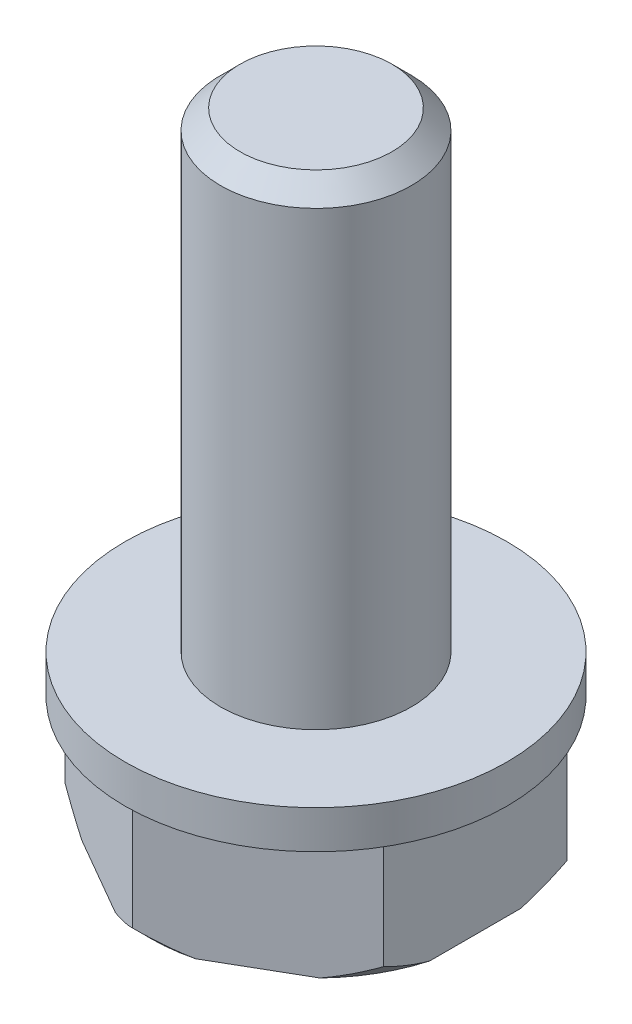
ISO-10303-21;
HEADER;
FILE_DESCRIPTION(('STEP AP214'),'2;1');
FILE_NAME('part.step','',(''),(''),'','','');
FILE_SCHEMA(('AUTOMOTIVE_DESIGN { 1 0 10303 214 1 1 1 1 }'));
ENDSEC;
DATA;
#1=APPLICATION_CONTEXT('core data for automotive mechanical design processes');
#2=APPLICATION_PROTOCOL_DEFINITION('international standard','automotive_design',2000,#1);
#3=PRODUCT_CONTEXT('',#1,'mechanical');
#4=PRODUCT('Part','Part','',(#3));
#5=PRODUCT_RELATED_PRODUCT_CATEGORY('part','',(#4));
#6=PRODUCT_DEFINITION_FORMATION('','',#4);
#7=PRODUCT_DEFINITION_CONTEXT('part definition',#1,'design');
#8=PRODUCT_DEFINITION('design','',#6,#7);
#9=PRODUCT_DEFINITION_SHAPE('','',#8);
#10=(LENGTH_UNIT() NAMED_UNIT(*) SI_UNIT(.MILLI.,.METRE.));
#11=(NAMED_UNIT(*) PLANE_ANGLE_UNIT() SI_UNIT($,.RADIAN.));
#12=(NAMED_UNIT(*) SI_UNIT($,.STERADIAN.) SOLID_ANGLE_UNIT());
#13=UNCERTAINTY_MEASURE_WITH_UNIT(LENGTH_MEASURE(1.E-05),#10,'distance_accuracy_value','');
#14=(GEOMETRIC_REPRESENTATION_CONTEXT(3) GLOBAL_UNCERTAINTY_ASSIGNED_CONTEXT((#13)) GLOBAL_UNIT_ASSIGNED_CONTEXT((#10,
#11,#12)) REPRESENTATION_CONTEXT('',''));
#15=CARTESIAN_POINT('',(0.,0.,0.));
#16=DIRECTION('',(0.,0.,1.));
#17=DIRECTION('',(1.,0.,0.));
#18=AXIS2_PLACEMENT_3D('',#15,#16,#17);
#19=CARTESIAN_POINT('',(22.6776695296637,96.5,14.7909181837156));
#20=DIRECTION('',(-0.5,0.,0.866025403784439));
#21=DIRECTION('',(0.866025403784439,0.,0.5));
#22=AXIS2_PLACEMENT_3D('',#19,#20,#21);
#23=PLANE('',#22);
#24=DIRECTION('',(0.,-1.,0.));
#25=VECTOR('',#24,1.);
#26=CARTESIAN_POINT('',(22.6776695296637,96.5,14.7909181837156));
#27=LINE('',#26,#25);
#28=CARTESIAN_POINT('',(22.6776695296637,50.5,14.7909181837156));
#29=VERTEX_POINT('',#28);
#30=CARTESIAN_POINT('',(22.6776695296637,47.0735026918963,14.7909181837156));
#31=VERTEX_POINT('',#30);
#32=EDGE_CURVE('E11',#29,#31,#27,.T.);
#33=ORIENTED_EDGE('',*,*,#32,.T.);
#34=CARTESIAN_POINT('',(21.414601217349,46.5,14.0616853535958));
#35=CARTESIAN_POINT('',(21.4664537594648,46.5164440766261,14.091623938227));
#36=CARTESIAN_POINT('',(21.5180895158105,46.5337687545802,14.1214486324146));
#37=CARTESIAN_POINT('',(21.6214874574526,46.5702823086314,14.1811796574282));
#38=CARTESIAN_POINT('',(21.6732446970938,46.5894897238432,14.2110832271335));
#39=CARTESIAN_POINT('',(21.7769756621481,46.6297670931508,14.2710096812821));
#40=CARTESIAN_POINT('',(21.8289432219276,46.6508582920278,14.3010289273305));
#41=CARTESIAN_POINT('',(21.9331790081629,46.6949003649628,14.3612296351021));
#42=CARTESIAN_POINT('',(21.9854399260141,46.7178745106764,14.3914067018588));
#43=CARTESIAN_POINT('',(22.0903392794409,46.7656807395659,14.4519664939412));
#44=CARTESIAN_POINT('',(22.1429693499514,46.7905375181192,14.4823441822286));
#45=CARTESIAN_POINT('',(22.2486773209186,46.8421079012049,14.5433494931069));
#46=CARTESIAN_POINT('',(22.3017459168783,46.8688470805479,14.5739715894766));
#47=CARTESIAN_POINT('',(22.4083946755418,46.9241810640024,14.6355096377957));
#48=CARTESIAN_POINT('',(22.4619647196343,46.9528018406309,14.6664197250956));
#49=CARTESIAN_POINT('',(22.56967482855,47.0119007649667,14.7285774640249));
#50=CARTESIAN_POINT('',(22.6238041115768,47.042404941688,14.7598190718213));
#51=CARTESIAN_POINT('',(22.6776695296637,47.0735026918963,14.7909181837156));
#52=B_SPLINE_CURVE_WITH_KNOTS('',3,(#34,#35,#36,#37,#38,#39,#40,#41,#42,#43,#44,#45,#46,#47,#48,
#49,#50,#51),.UNSPECIFIED.,.F.,.F.,(4,2,2,2,2,2,2,2,4),(0.,0.18626522227709,0.374595608167035,
0.565412784427951,0.759111232115713,0.956057798253879,1.15659171756843,1.36102506604505,
1.56964356219137),.UNSPECIFIED.);
#53=CARTESIAN_POINT('',(21.414601217349,46.5,14.0616853535958));
#54=VERTEX_POINT('',#53);
#55=EDGE_CURVE('E123',#54,#31,#52,.T.);
#56=ORIENTED_EDGE('',*,*,#55,.F.);
#57=DIRECTION('',(0.866025403784439,0.,0.5));
#58=VECTOR('',#57,1.);
#59=CARTESIAN_POINT('',(24.0776695296637,46.5,15.5992085605811));
#60=LINE('',#59,#58);
#61=CARTESIAN_POINT('',(18.9407378419784,46.5,12.6333996678872));
#62=VERTEX_POINT('',#61);
#63=EDGE_CURVE('E127',#62,#54,#60,.T.);
#64=ORIENTED_EDGE('',*,*,#63,.F.);
#65=CARTESIAN_POINT('',(17.6776695296637,47.0735026918963,11.9041668377674));
#66=CARTESIAN_POINT('',(17.7315348596427,47.042404941688,11.9352661022691));
#67=CARTESIAN_POINT('',(17.7856555271629,47.0119007649667,11.9665226325607));
#68=CARTESIAN_POINT('',(17.8933407625753,46.9528018406309,12.0287234536614));
#69=CARTESIAN_POINT('',(17.9468947054565,46.9241810640024,12.0596614290774));
#70=CARTESIAN_POINT('',(18.0535125979319,46.8688470805479,12.1212529392026));
#71=CARTESIAN_POINT('',(18.1065664092851,46.8421079012049,12.1519006432619));
#72=CARTESIAN_POINT('',(18.212252543755,46.7905375181192,12.2129437760629));
#73=CARTESIAN_POINT('',(18.2648754287754,46.7656807395659,12.2433339099842));
#74=CARTESIAN_POINT('',(18.36977142388,46.7178745106764,12.3038995188512));
#75=CARTESIAN_POINT('',(18.4220359892286,46.6949003649628,12.3340702679571));
#76=CARTESIAN_POINT('',(18.5262892246024,46.6508582920278,12.3942407529346));
#77=CARTESIAN_POINT('',(18.5782704341724,46.6297670931507,12.424236356852));
#78=CARTESIAN_POINT('',(18.682033748351,46.5894897238432,12.4841067806739));
#79=CARTESIAN_POINT('',(18.7338096192002,46.5702823086314,12.5139780801803));
#80=CARTESIAN_POINT('',(18.8372371750771,46.5337687545802,12.5736578118346));
#81=CARTESIAN_POINT('',(18.8888839960765,46.5164440766261,12.6034633414798));
#82=CARTESIAN_POINT('',(18.9407378419784,46.5,12.6333996678872));
#83=B_SPLINE_CURVE_WITH_KNOTS('',3,(#65,#66,#67,#68,#69,#70,#71,#72,#73,#74,#75,#76,#77,#78,#79,
#80,#81,#82),.UNSPECIFIED.,.F.,.F.,(4,2,2,2,2,2,2,2,4),(0.,0.208618496146334,0.413051844622961,
0.61358576393752,0.810532330075687,1.00423077776346,1.19504795402437,1.38337833991431,
1.56964356219139),.UNSPECIFIED.);
#84=CARTESIAN_POINT('',(17.6776695296637,47.0735026918963,11.9041668377674));
#85=VERTEX_POINT('',#84);
#86=EDGE_CURVE('E119',#85,#62,#83,.T.);
#87=ORIENTED_EDGE('',*,*,#86,.F.);
#88=DIRECTION('',(0.,-1.,0.));
#89=VECTOR('',#88,1.);
#90=CARTESIAN_POINT('',(17.6776695296637,96.5,11.9041668377674));
#91=LINE('',#90,#89);
#92=CARTESIAN_POINT('',(17.6776695296637,50.5,11.9041668377674));
#93=VERTEX_POINT('',#92);
#94=EDGE_CURVE('E503',#93,#85,#91,.T.);
#95=ORIENTED_EDGE('',*,*,#94,.F.);
#96=DIRECTION('',(-0.866025403784439,0.,-0.5));
#97=VECTOR('',#96,1.);
#98=CARTESIAN_POINT('',(22.4276695296637,50.5,14.6465806164181));
#99=LINE('',#98,#97);
#100=EDGE_CURVE('E472',#29,#93,#99,.T.);
#101=ORIENTED_EDGE('',*,*,#100,.F.);
#102=EDGE_LOOP('',(#33,#56,#64,#87,#95,#101));
#103=FACE_BOUND('',#102,.T.);
#104=ADVANCED_FACE('F16',(#103),#23,.F.);
#105=CARTESIAN_POINT('',(22.6776695296637,96.5,20.5644208756118));
#106=DIRECTION('',(-1.,0.,0.));
#107=DIRECTION('',(0.,0.,1.));
#108=AXIS2_PLACEMENT_3D('',#105,#106,#107);
#109=PLANE('',#108);
#110=DIRECTION('',(0.,-1.,0.));
#111=VECTOR('',#110,1.);
#112=CARTESIAN_POINT('',(22.6776695296637,96.5,20.5644208756118));
#113=LINE('',#112,#111);
#114=CARTESIAN_POINT('',(22.6776695296637,50.5,20.5644208756118));
#115=VERTEX_POINT('',#114);
#116=CARTESIAN_POINT('',(22.6776695296637,47.0735026918963,20.5644208756118));
#117=VERTEX_POINT('',#116);
#118=EDGE_CURVE('E347',#115,#117,#113,.T.);
#119=ORIENTED_EDGE('',*,*,#118,.T.);
#120=CARTESIAN_POINT('',(22.6776695296637,46.5,19.1059552153723));
#121=CARTESIAN_POINT('',(22.6776682258776,46.5164440766261,19.1658301264109));
#122=CARTESIAN_POINT('',(22.6776571612239,46.5337687545802,19.2254603502437));
#123=CARTESIAN_POINT('',(22.6776275469891,46.5702823086314,19.3448711069116));
#124=CARTESIAN_POINT('',(22.6776089157811,46.5894897238432,19.4046459761233));
#125=CARTESIAN_POINT('',(22.6775765666569,46.6297670931507,19.5244428540937));
#126=CARTESIAN_POINT('',(22.6775629168662,46.6508582920278,19.5844577040596));
#127=CARTESIAN_POINT('',(22.6775454677278,46.6949003649628,19.7048288968087));
#128=CARTESIAN_POINT('',(22.6775418202305,46.7178745106764,19.7651767126713));
#129=CARTESIAN_POINT('',(22.6775451785526,46.7656807395659,19.8863021136206));
#130=CARTESIAN_POINT('',(22.6775523640427,46.7905375181192,19.9470699358293));
#131=CARTESIAN_POINT('',(22.67757420054,46.8421079012049,20.0691183795086));
#132=CARTESIAN_POINT('',(22.6775889851464,46.8688470805479,20.1303881799377));
#133=CARTESIAN_POINT('',(22.6776198513346,46.9241810640024,20.2535177383819));
#134=CARTESIAN_POINT('',(22.677635952546,46.9528018406309,20.3153658010979));
#135=CARTESIAN_POINT('',(22.6776608260492,47.0119007649667,20.4397243611279));
#136=CARTESIAN_POINT('',(22.6776694415558,47.042404941688,20.502222499216));
#137=CARTESIAN_POINT('',(22.6776695296637,47.0735026918963,20.5644208756118));
#138=B_SPLINE_CURVE_WITH_KNOTS('',3,(#120,#121,#122,#123,#124,#125,#126,#127,#128,#129,#130,
#131,#132,#133,#134,#135,#136,#137),.UNSPECIFIED.,.F.,.F.,(4,2,2,2,2,2,2,2,4),(0.,
0.186265222277086,0.37459560816702,0.565412784427934,0.759111232115698,0.956057798253866,
1.15659171756843,1.36102506604505,1.56964356219139),.UNSPECIFIED.);
#139=CARTESIAN_POINT('',(22.6776695296637,46.5,19.1059552153723));
#140=VERTEX_POINT('',#139);
#141=EDGE_CURVE('E28',#140,#117,#138,.T.);
#142=ORIENTED_EDGE('',*,*,#141,.F.);
#143=DIRECTION('',(0.,0.,1.));
#144=VECTOR('',#143,1.);
#145=CARTESIAN_POINT('',(22.6776695296637,46.5,17.6776695296637));
#146=LINE('',#145,#144);
#147=CARTESIAN_POINT('',(22.6776695296637,46.5,16.2493838439551));
#148=VERTEX_POINT('',#147);
#149=EDGE_CURVE('E140',#148,#140,#146,.T.);
#150=ORIENTED_EDGE('',*,*,#149,.F.);
#151=CARTESIAN_POINT('',(22.6776695296637,47.0735026918963,14.7909181837156));
#152=CARTESIAN_POINT('',(22.6776694415558,47.0424049416879,14.8531165601115));
#153=CARTESIAN_POINT('',(22.6776608260492,47.0119007649667,14.9156146981996));
#154=CARTESIAN_POINT('',(22.677635952546,46.9528018406309,15.0399732582295));
#155=CARTESIAN_POINT('',(22.6776198513346,46.9241810640024,15.1018213209455));
#156=CARTESIAN_POINT('',(22.6775889851464,46.8688470805479,15.2249508793897));
#157=CARTESIAN_POINT('',(22.67757420054,46.8421079012049,15.2862206798188));
#158=CARTESIAN_POINT('',(22.6775523640427,46.7905375181192,15.4082691234981));
#159=CARTESIAN_POINT('',(22.6775451785526,46.7656807395659,15.4690369457068));
#160=CARTESIAN_POINT('',(22.6775418202304,46.7178745106764,15.5901623466562));
#161=CARTESIAN_POINT('',(22.6775454677278,46.6949003649628,15.6505101625187));
#162=CARTESIAN_POINT('',(22.6775629168662,46.6508582920278,15.7708813552679));
#163=CARTESIAN_POINT('',(22.6775765666568,46.6297670931507,15.8308962052337));
#164=CARTESIAN_POINT('',(22.6776089157811,46.5894897238432,15.9506930832041));
#165=CARTESIAN_POINT('',(22.6776275469891,46.5702823086314,16.0104679524158));
#166=CARTESIAN_POINT('',(22.6776571612239,46.5337687545802,16.1298787090837));
#167=CARTESIAN_POINT('',(22.6776682258776,46.5164440766261,16.1895089329165));
#168=CARTESIAN_POINT('',(22.6776695296637,46.5,16.2493838439551));
#169=B_SPLINE_CURVE_WITH_KNOTS('',3,(#151,#152,#153,#154,#155,#156,#157,#158,#159,#160,#161,
#162,#163,#164,#165,#166,#167,#168),.UNSPECIFIED.,.F.,.F.,(4,2,2,2,2,2,2,2,4),(0.,
0.208618496146355,0.413051844622992,0.613585763937557,0.810532330075726,1.00423077776349,
1.19504795402439,1.38337833991431,1.56964356219138),.UNSPECIFIED.);
#170=EDGE_CURVE('E131',#31,#148,#169,.T.);
#171=ORIENTED_EDGE('',*,*,#170,.F.);
#172=ORIENTED_EDGE('',*,*,#32,.F.);
#173=DIRECTION('',(0.,0.,-1.));
#174=VECTOR('',#173,1.);
#175=CARTESIAN_POINT('',(22.6776695296637,50.5,17.6776695296637));
#176=LINE('',#175,#174);
#177=EDGE_CURVE('E469',#115,#29,#176,.T.);
#178=ORIENTED_EDGE('',*,*,#177,.F.);
#179=EDGE_LOOP('',(#119,#142,#150,#171,#172,#178));
#180=FACE_BOUND('',#179,.T.);
#181=ADVANCED_FACE('F411',(#180),#109,.F.);
#182=CARTESIAN_POINT('',(17.6776695296637,47.3,17.6776695296637));
#183=DIRECTION('',(0.,1.,0.));
#184=DIRECTION('',(0.,0.,1.));
#185=AXIS2_PLACEMENT_3D('',#182,#183,#184);
#186=CONICAL_SURFACE('',#185,6.,0.785398163397448);
#187=CARTESIAN_POINT('',(17.6776695296637,46.5,17.6776695296637));
#188=DIRECTION('',(0.,-1.,0.));
#189=DIRECTION('',(0.,0.,-1.));
#190=AXIS2_PLACEMENT_3D('',#187,#188,#189);
#191=CIRCLE('',#190,5.2);
#192=CARTESIAN_POINT('',(21.414601217349,46.5,21.2936537057316));
#193=VERTEX_POINT('',#192);
#194=EDGE_CURVE('E333',#140,#193,#191,.T.);
#195=ORIENTED_EDGE('',*,*,#194,.F.);
#196=ORIENTED_EDGE('',*,*,#141,.T.);
#197=CARTESIAN_POINT('',(22.6776695296637,47.0735026918963,20.5644208756118));
#198=CARTESIAN_POINT('',(22.6238041115768,47.042404941688,20.5955199875061));
#199=CARTESIAN_POINT('',(22.56967482855,47.0119007649667,20.6267615953025));
#200=CARTESIAN_POINT('',(22.4619647196343,46.9528018406309,20.6889193342319));
#201=CARTESIAN_POINT('',(22.4083946755418,46.9241810640024,20.7198294215318));
#202=CARTESIAN_POINT('',(22.3017459168782,46.8688470805479,20.7813674698508));
#203=CARTESIAN_POINT('',(22.2486773209186,46.8421079012049,20.8119895662206));
#204=CARTESIAN_POINT('',(22.1429693499514,46.7905375181192,20.8729948770988));
#205=CARTESIAN_POINT('',(22.0903392794409,46.7656807395659,20.9033725653862));
#206=CARTESIAN_POINT('',(21.9854399260141,46.7178745106764,20.9639323574686));
#207=CARTESIAN_POINT('',(21.9331790081629,46.6949003649628,20.9941094242253));
#208=CARTESIAN_POINT('',(21.8289432219275,46.6508582920278,21.054310131997));
#209=CARTESIAN_POINT('',(21.7769756621481,46.6297670931507,21.0843293780454));
#210=CARTESIAN_POINT('',(21.6732446970938,46.5894897238432,21.1442558321939));
#211=CARTESIAN_POINT('',(21.6214874574525,46.5702823086314,21.1741594018992));
#212=CARTESIAN_POINT('',(21.5180895158105,46.5337687545802,21.2338904269128));
#213=CARTESIAN_POINT('',(21.4664537594648,46.5164440766261,21.2637151211004));
#214=CARTESIAN_POINT('',(21.414601217349,46.5,21.2936537057316));
#215=B_SPLINE_CURVE_WITH_KNOTS('',3,(#197,#198,#199,#200,#201,#202,#203,#204,#205,#206,#207,
#208,#209,#210,#211,#212,#213,#214),.UNSPECIFIED.,.F.,.F.,(4,2,2,2,2,2,2,2,4),(0.,
0.208618496146343,0.413051844622975,0.613585763937536,0.810532330075706,1.00423077776347,
1.19504795402438,1.38337833991431,1.56964356219138),.UNSPECIFIED.);
#216=EDGE_CURVE('E388',#117,#193,#215,.T.);
#217=ORIENTED_EDGE('',*,*,#216,.T.);
#218=EDGE_LOOP('',(#195,#196,#217));
#219=FACE_BOUND('',#218,.T.);
#220=ADVANCED_FACE('F173',(#219),#186,.T.);
#221=CARTESIAN_POINT('',(17.6776695296637,47.3,17.6776695296637));
#222=DIRECTION('',(0.,1.,0.));
#223=DIRECTION('',(0.,0.,1.));
#224=AXIS2_PLACEMENT_3D('',#221,#222,#223);
#225=CONICAL_SURFACE('',#224,6.,0.785398163397448);
#226=CARTESIAN_POINT('',(17.6776695296637,46.5,17.6776695296637));
#227=DIRECTION('',(0.,-1.,0.));
#228=DIRECTION('',(0.,0.,-1.));
#229=AXIS2_PLACEMENT_3D('',#226,#227,#228);
#230=CIRCLE('',#229,5.2);
#231=EDGE_CURVE('E135',#54,#148,#230,.T.);
#232=ORIENTED_EDGE('',*,*,#231,.F.);
#233=ORIENTED_EDGE('',*,*,#55,.T.);
#234=ORIENTED_EDGE('',*,*,#170,.T.);
#235=EDGE_LOOP('',(#232,#233,#234));
#236=FACE_BOUND('',#235,.T.);
#237=ADVANCED_FACE('F136',(#236),#225,.T.);
#238=CARTESIAN_POINT('',(17.6776695296637,47.3,17.6776695296637));
#239=DIRECTION('',(0.,1.,0.));
#240=DIRECTION('',(0.,0.,1.));
#241=AXIS2_PLACEMENT_3D('',#238,#239,#240);
#242=CONICAL_SURFACE('',#241,6.,0.785398163397448);
#243=CARTESIAN_POINT('',(17.6776695296637,46.5,17.6776695296637));
#244=DIRECTION('',(0.,-1.,0.));
#245=DIRECTION('',(0.,0.,-1.));
#246=AXIS2_PLACEMENT_3D('',#243,#244,#245);
#247=CIRCLE('',#246,5.2);
#248=CARTESIAN_POINT('',(16.414601217349,46.5,12.6333996678872));
#249=VERTEX_POINT('',#248);
#250=EDGE_CURVE('E144',#249,#62,#247,.T.);
#251=ORIENTED_EDGE('',*,*,#250,.F.);
#252=CARTESIAN_POINT('',(16.414601217349,46.5,12.6333996678872));
#253=CARTESIAN_POINT('',(16.4664550632509,46.5164440766261,12.6034633414798));
#254=CARTESIAN_POINT('',(16.5181018842503,46.5337687545802,12.5736578118346));
#255=CARTESIAN_POINT('',(16.6215294401272,46.5702823086314,12.5139780801803));
#256=CARTESIAN_POINT('',(16.6733053109764,46.5894897238432,12.4841067806739));
#257=CARTESIAN_POINT('',(16.777068625155,46.6297670931507,12.424236356852));
#258=CARTESIAN_POINT('',(16.829049834725,46.6508582920278,12.3942407529346));
#259=CARTESIAN_POINT('',(16.9333030700988,46.6949003649628,12.3340702679571));
#260=CARTESIAN_POINT('',(16.9855676354474,46.7178745106764,12.3038995188512));
#261=CARTESIAN_POINT('',(17.090463630552,46.7656807395659,12.2433339099842));
#262=CARTESIAN_POINT('',(17.1430865155724,46.7905375181192,12.2129437760629));
#263=CARTESIAN_POINT('',(17.2487726500424,46.8421079012049,12.1519006432619));
#264=CARTESIAN_POINT('',(17.3018264613956,46.8688470805479,12.1212529392026));
#265=CARTESIAN_POINT('',(17.4084443538709,46.9241810640024,12.0596614290774));
#266=CARTESIAN_POINT('',(17.4619982967521,46.9528018406309,12.0287234536614));
#267=CARTESIAN_POINT('',(17.5696835321645,47.0119007649667,11.9665226325607));
#268=CARTESIAN_POINT('',(17.6238041996847,47.0424049416879,11.9352661022691));
#269=CARTESIAN_POINT('',(17.6776695296637,47.0735026918963,11.9041668377675));
#270=B_SPLINE_CURVE_WITH_KNOTS('',3,(#252,#253,#254,#255,#256,#257,#258,#259,#260,#261,#262,
#263,#264,#265,#266,#267,#268,#269),.UNSPECIFIED.,.F.,.F.,(4,2,2,2,2,2,2,2,4),(0.,
0.186265222277095,0.374595608167032,0.565412784427947,0.759111232115718,0.956057798253885,
1.15659171756844,1.36102506604506,1.56964356219139),.UNSPECIFIED.);
#271=EDGE_CURVE('E192',#249,#85,#270,.T.);
#272=ORIENTED_EDGE('',*,*,#271,.T.);
#273=ORIENTED_EDGE('',*,*,#86,.T.);
#274=EDGE_LOOP('',(#251,#272,#273));
#275=FACE_BOUND('',#274,.T.);
#276=ADVANCED_FACE('F159',(#275),#242,.T.);
#277=CARTESIAN_POINT('',(17.6776695296637,51.7,17.6776695296637));
#278=DIRECTION('',(0.,-1.,0.));
#279=DIRECTION('',(0.,0.,-1.));
#280=AXIS2_PLACEMENT_3D('',#277,#278,#279);
#281=PLANE('',#280);
#282=CARTESIAN_POINT('',(17.6776695296637,51.7,17.6776695296637));
#283=DIRECTION('',(0.,-1.,0.));
#284=DIRECTION('',(0.,0.,-1.));
#285=AXIS2_PLACEMENT_3D('',#282,#283,#284);
#286=CIRCLE('',#285,3.);
#287=CARTESIAN_POINT('',(17.6776695296637,51.7,14.6776695296637));
#288=VERTEX_POINT('',#287);
#289=EDGE_CURVE('E54',#288,#288,#286,.T.);
#290=ORIENTED_EDGE('',*,*,#289,.T.);
#291=EDGE_LOOP('',(#290));
#292=FACE_BOUND('',#291,.T.);
#293=CARTESIAN_POINT('',(17.6776695296637,51.7,17.6776695296637));
#294=DIRECTION('',(0.,-1.,0.));
#295=DIRECTION('',(0.,0.,-1.));
#296=AXIS2_PLACEMENT_3D('',#293,#294,#295);
#297=CIRCLE('',#296,6.);
#298=CARTESIAN_POINT('',(17.6776695296637,51.7,11.6776695296637));
#299=VERTEX_POINT('',#298);
#300=EDGE_CURVE('E498',#299,#299,#297,.T.);
#301=ORIENTED_EDGE('',*,*,#300,.F.);
#302=EDGE_LOOP('',(#301));
#303=FACE_BOUND('',#302,.T.);
#304=ADVANCED_FACE('F169',(#292,#303),#281,.F.);
#305=CARTESIAN_POINT('',(17.6776695296637,47.3,17.6776695296637));
#306=DIRECTION('',(0.,1.,0.));
#307=DIRECTION('',(0.,0.,1.));
#308=AXIS2_PLACEMENT_3D('',#305,#306,#307);
#309=CONICAL_SURFACE('',#308,6.,0.785398163397448);
#310=CARTESIAN_POINT('',(17.6776695296637,46.5,17.6776695296637));
#311=DIRECTION('',(0.,-1.,0.));
#312=DIRECTION('',(0.,0.,-1.));
#313=AXIS2_PLACEMENT_3D('',#310,#311,#312);
#314=CIRCLE('',#313,5.2);
#315=CARTESIAN_POINT('',(12.6776695296637,46.5,16.2493838439551));
#316=VERTEX_POINT('',#315);
#317=CARTESIAN_POINT('',(13.9407378419784,46.5,14.0616853535958));
#318=VERTEX_POINT('',#317);
#319=EDGE_CURVE('E234',#316,#318,#314,.T.);
#320=ORIENTED_EDGE('',*,*,#319,.F.);
#321=CARTESIAN_POINT('',(12.6776695296637,46.5,16.2493838439551));
#322=CARTESIAN_POINT('',(12.6776708334498,46.5164440766261,16.1895089329165));
#323=CARTESIAN_POINT('',(12.6776818981035,46.5337687545802,16.1298787090837));
#324=CARTESIAN_POINT('',(12.6777115123383,46.5702823086314,16.0104679524158));
#325=CARTESIAN_POINT('',(12.6777301435463,46.5894897238432,15.9506930832041));
#326=CARTESIAN_POINT('',(12.6777624926705,46.6297670931507,15.8308962052337));
#327=CARTESIAN_POINT('',(12.6777761424612,46.6508582920278,15.7708813552678));
#328=CARTESIAN_POINT('',(12.6777935915996,46.6949003649628,15.6505101625187));
#329=CARTESIAN_POINT('',(12.677797239097,46.7178745106764,15.5901623466561));
#330=CARTESIAN_POINT('',(12.6777938807748,46.7656807395659,15.4690369457068));
#331=CARTESIAN_POINT('',(12.6777866952847,46.7905375181192,15.408269123498));
#332=CARTESIAN_POINT('',(12.6777648587874,46.8421079012049,15.2862206798188));
#333=CARTESIAN_POINT('',(12.677750074181,46.8688470805479,15.2249508793897));
#334=CARTESIAN_POINT('',(12.6777192079928,46.9241810640024,15.1018213209455));
#335=CARTESIAN_POINT('',(12.6777031067815,46.9528018406309,15.0399732582295));
#336=CARTESIAN_POINT('',(12.6776782332782,47.0119007649667,14.9156146981995));
#337=CARTESIAN_POINT('',(12.6776696177716,47.042404941688,14.8531165601114));
#338=CARTESIAN_POINT('',(12.6776695296637,47.0735026918963,14.7909181837156));
#339=B_SPLINE_CURVE_WITH_KNOTS('',3,(#321,#322,#323,#324,#325,#326,#327,#328,#329,#330,#331,
#332,#333,#334,#335,#336,#337,#338),.UNSPECIFIED.,.F.,.F.,(4,2,2,2,2,2,2,2,4),(0.,
0.186265222277096,0.37459560816703,0.56541278442795,0.759111232115718,0.956057798253889,
1.15659171756845,1.36102506604506,1.56964356219139),.UNSPECIFIED.);
#340=CARTESIAN_POINT('',(12.6776695296637,47.0735026918963,14.7909181837156));
#341=VERTEX_POINT('',#340);
#342=EDGE_CURVE('E229',#316,#341,#339,.T.);
#343=ORIENTED_EDGE('',*,*,#342,.T.);
#344=CARTESIAN_POINT('',(12.6776695296637,47.0735026918963,14.7909181837156));
#345=CARTESIAN_POINT('',(12.7315349477506,47.042404941688,14.7598190718213));
#346=CARTESIAN_POINT('',(12.7856642307774,47.0119007649667,14.7285774640249));
#347=CARTESIAN_POINT('',(12.8933743396931,46.9528018406309,14.6664197250956));
#348=CARTESIAN_POINT('',(12.9469443837856,46.9241810640024,14.6355096377957));
#349=CARTESIAN_POINT('',(13.0535931424492,46.8688470805479,14.5739715894766));
#350=CARTESIAN_POINT('',(13.1066617384088,46.8421079012049,14.5433494931068));
#351=CARTESIAN_POINT('',(13.212369709376,46.7905375181192,14.4823441822286));
#352=CARTESIAN_POINT('',(13.2649997798865,46.7656807395659,14.4519664939412));
#353=CARTESIAN_POINT('',(13.3698991333133,46.7178745106764,14.3914067018588));
#354=CARTESIAN_POINT('',(13.4221600511645,46.6949003649628,14.3612296351021));
#355=CARTESIAN_POINT('',(13.5263958373999,46.6508582920278,14.3010289273304));
#356=CARTESIAN_POINT('',(13.5783633971793,46.6297670931507,14.2710096812821));
#357=CARTESIAN_POINT('',(13.6820943622336,46.5894897238432,14.2110832271335));
#358=CARTESIAN_POINT('',(13.7338516018748,46.5702823086314,14.1811796574282));
#359=CARTESIAN_POINT('',(13.8372495435169,46.5337687545802,14.1214486324146));
#360=CARTESIAN_POINT('',(13.8888852998626,46.5164440766261,14.091623938227));
#361=CARTESIAN_POINT('',(13.9407378419784,46.5,14.0616853535958));
#362=B_SPLINE_CURVE_WITH_KNOTS('',3,(#344,#345,#346,#347,#348,#349,#350,#351,#352,#353,#354,
#355,#356,#357,#358,#359,#360,#361),.UNSPECIFIED.,.F.,.F.,(4,2,2,2,2,2,2,2,4),(0.,
0.208618496146333,0.413051844622951,0.613585763937507,0.810532330075671,1.00423077776344,
1.19504795402435,1.38337833991428,1.56964356219137),.UNSPECIFIED.);
#363=EDGE_CURVE('E499',#341,#318,#362,.T.);
#364=ORIENTED_EDGE('',*,*,#363,.T.);
#365=EDGE_LOOP('',(#320,#343,#364));
#366=FACE_BOUND('',#365,.T.);
#367=ADVANCED_FACE('F170',(#366),#309,.T.);
#368=CARTESIAN_POINT('',(17.6776695296637,50.5,17.6776695296637));
#369=DIRECTION('',(0.,-1.,0.));
#370=DIRECTION('',(0.,0.,-1.));
#371=AXIS2_PLACEMENT_3D('',#368,#369,#370);
#372=CYLINDRICAL_SURFACE('',#371,6.);
#373=ORIENTED_EDGE('',*,*,#300,.T.);
#374=EDGE_LOOP('',(#373));
#375=FACE_BOUND('',#374,.T.);
#376=CARTESIAN_POINT('',(17.6776695296637,50.5,17.6776695296637));
#377=DIRECTION('',(0.,-1.,0.));
#378=DIRECTION('',(0.,0.,-1.));
#379=AXIS2_PLACEMENT_3D('',#376,#377,#378);
#380=CIRCLE('',#379,6.);
#381=CARTESIAN_POINT('',(17.6776695296637,50.5,11.6776695296637));
#382=VERTEX_POINT('',#381);
#383=EDGE_CURVE('E230',#382,#382,#380,.T.);
#384=ORIENTED_EDGE('',*,*,#383,.F.);
#385=EDGE_LOOP('',(#384));
#386=FACE_BOUND('',#385,.T.);
#387=ADVANCED_FACE('F210',(#375,#386),#372,.T.);
#388=CARTESIAN_POINT('',(17.6776695296637,96.5,11.9041668377674));
#389=DIRECTION('',(0.5,0.,0.866025403784439));
#390=DIRECTION('',(0.866025403784439,0.,-0.5));
#391=AXIS2_PLACEMENT_3D('',#388,#389,#390);
#392=PLANE('',#391);
#393=ORIENTED_EDGE('',*,*,#94,.T.);
#394=ORIENTED_EDGE('',*,*,#271,.F.);
#395=DIRECTION('',(0.866025403784439,0.,-0.5));
#396=VECTOR('',#395,1.);
#397=CARTESIAN_POINT('',(19.0776695296637,46.5,11.0958764609019));
#398=LINE('',#397,#396);
#399=EDGE_CURVE('E146',#318,#249,#398,.T.);
#400=ORIENTED_EDGE('',*,*,#399,.F.);
#401=ORIENTED_EDGE('',*,*,#363,.F.);
#402=DIRECTION('',(0.,-1.,0.));
#403=VECTOR('',#402,1.);
#404=CARTESIAN_POINT('',(12.6776695296637,96.5,14.7909181837156));
#405=LINE('',#404,#403);
#406=CARTESIAN_POINT('',(12.6776695296637,50.5,14.7909181837156));
#407=VERTEX_POINT('',#406);
#408=EDGE_CURVE('E221',#407,#341,#405,.T.);
#409=ORIENTED_EDGE('',*,*,#408,.F.);
#410=DIRECTION('',(-0.866025403784439,0.,0.5));
#411=VECTOR('',#410,1.);
#412=CARTESIAN_POINT('',(17.4276695296637,50.5,12.0485044050648));
#413=LINE('',#412,#411);
#414=EDGE_CURVE('E489',#93,#407,#413,.T.);
#415=ORIENTED_EDGE('',*,*,#414,.F.);
#416=EDGE_LOOP('',(#393,#394,#400,#401,#409,#415));
#417=FACE_BOUND('',#416,.T.);
#418=ADVANCED_FACE('F199',(#417),#392,.F.);
#419=CARTESIAN_POINT('',(12.6776695296637,96.5,14.7909181837156));
#420=DIRECTION('',(1.,0.,0.));
#421=DIRECTION('',(0.,0.,-1.));
#422=AXIS2_PLACEMENT_3D('',#419,#420,#421);
#423=PLANE('',#422);
#424=ORIENTED_EDGE('',*,*,#408,.T.);
#425=ORIENTED_EDGE('',*,*,#342,.F.);
#426=DIRECTION('',(0.,0.,-1.));
#427=VECTOR('',#426,1.);
#428=CARTESIAN_POINT('',(12.6776695296637,46.5,17.6776695296637));
#429=LINE('',#428,#427);
#430=CARTESIAN_POINT('',(12.6776695296637,46.5,19.1059552153723));
#431=VERTEX_POINT('',#430);
#432=EDGE_CURVE('E238',#431,#316,#429,.T.);
#433=ORIENTED_EDGE('',*,*,#432,.F.);
#434=CARTESIAN_POINT('',(12.6776695296637,47.0735026918963,20.5644208756118));
#435=CARTESIAN_POINT('',(12.6776696177716,47.0424049416879,20.502222499216));
#436=CARTESIAN_POINT('',(12.6776782332782,47.0119007649667,20.4397243611279));
#437=CARTESIAN_POINT('',(12.6777031067814,46.9528018406309,20.3153658010979));
#438=CARTESIAN_POINT('',(12.6777192079928,46.9241810640024,20.2535177383819));
#439=CARTESIAN_POINT('',(12.677750074181,46.8688470805479,20.1303881799377));
#440=CARTESIAN_POINT('',(12.6777648587874,46.8421079012049,20.0691183795086));
#441=CARTESIAN_POINT('',(12.6777866952847,46.7905375181192,19.9470699358293));
#442=CARTESIAN_POINT('',(12.6777938807748,46.7656807395659,19.8863021136206));
#443=CARTESIAN_POINT('',(12.677797239097,46.7178745106764,19.7651767126712));
#444=CARTESIAN_POINT('',(12.6777935915996,46.6949003649628,19.7048288968087));
#445=CARTESIAN_POINT('',(12.6777761424612,46.6508582920278,19.5844577040595));
#446=CARTESIAN_POINT('',(12.6777624926706,46.6297670931507,19.5244428540937));
#447=CARTESIAN_POINT('',(12.6777301435463,46.5894897238432,19.4046459761233));
#448=CARTESIAN_POINT('',(12.6777115123383,46.5702823086314,19.3448711069116));
#449=CARTESIAN_POINT('',(12.6776818981035,46.5337687545802,19.2254603502437));
#450=CARTESIAN_POINT('',(12.6776708334498,46.5164440766261,19.165830126411));
#451=CARTESIAN_POINT('',(12.6776695296637,46.5,19.1059552153723));
#452=B_SPLINE_CURVE_WITH_KNOTS('',3,(#434,#435,#436,#437,#438,#439,#440,#441,#442,#443,#444,
#445,#446,#447,#448,#449,#450,#451),.UNSPECIFIED.,.F.,.F.,(4,2,2,2,2,2,2,2,4),(0.,
0.208618496146364,0.413051844623002,0.613585763937568,0.810532330075742,1.0042307777635,
1.1950479540244,1.38337833991432,1.56964356219138),.UNSPECIFIED.);
#453=CARTESIAN_POINT('',(12.6776695296637,47.0735026918963,20.5644208756118));
#454=VERTEX_POINT('',#453);
#455=EDGE_CURVE('E258',#454,#431,#452,.T.);
#456=ORIENTED_EDGE('',*,*,#455,.F.);
#457=DIRECTION('',(0.,-1.,0.));
#458=VECTOR('',#457,1.);
#459=CARTESIAN_POINT('',(12.6776695296637,96.5,20.5644208756118));
#460=LINE('',#459,#458);
#461=CARTESIAN_POINT('',(12.6776695296637,50.5,20.5644208756118));
#462=VERTEX_POINT('',#461);
#463=EDGE_CURVE('E341',#462,#454,#460,.T.);
#464=ORIENTED_EDGE('',*,*,#463,.F.);
#465=DIRECTION('',(0.,0.,1.));
#466=VECTOR('',#465,1.);
#467=CARTESIAN_POINT('',(12.6776695296637,50.5,17.6776695296637));
#468=LINE('',#467,#466);
#469=EDGE_CURVE('E477',#407,#462,#468,.T.);
#470=ORIENTED_EDGE('',*,*,#469,.F.);
#471=EDGE_LOOP('',(#424,#425,#433,#456,#464,#470));
#472=FACE_BOUND('',#471,.T.);
#473=ADVANCED_FACE('F209',(#472),#423,.F.);
#474=CARTESIAN_POINT('',(23.6776695296637,50.5,17.6776695296637));
#475=DIRECTION('',(0.,1.,0.));
#476=DIRECTION('',(0.,0.,1.));
#477=AXIS2_PLACEMENT_3D('',#474,#475,#476);
#478=PLANE('',#477);
#479=ORIENTED_EDGE('',*,*,#383,.T.);
#480=EDGE_LOOP('',(#479));
#481=FACE_BOUND('',#480,.T.);
#482=ORIENTED_EDGE('',*,*,#177,.T.);
#483=ORIENTED_EDGE('',*,*,#100,.T.);
#484=ORIENTED_EDGE('',*,*,#414,.T.);
#485=ORIENTED_EDGE('',*,*,#469,.T.);
#486=DIRECTION('',(0.866025403784439,0.,0.5));
#487=VECTOR('',#486,1.);
#488=CARTESIAN_POINT('',(17.4276695296637,50.5,23.3068346542625));
#489=LINE('',#488,#487);
#490=CARTESIAN_POINT('',(17.6776695296637,50.5,23.4511722215599));
#491=VERTEX_POINT('',#490);
#492=EDGE_CURVE('E245',#462,#491,#489,.T.);
#493=ORIENTED_EDGE('',*,*,#492,.T.);
#494=DIRECTION('',(0.866025403784439,0.,-0.5));
#495=VECTOR('',#494,1.);
#496=CARTESIAN_POINT('',(22.4276695296637,50.5,20.7087584429092));
#497=LINE('',#496,#495);
#498=EDGE_CURVE('E342',#491,#115,#497,.T.);
#499=ORIENTED_EDGE('',*,*,#498,.T.);
#500=EDGE_LOOP('',(#482,#483,#484,#485,#493,#499));
#501=FACE_BOUND('',#500,.T.);
#502=ADVANCED_FACE('F448',(#481,#501),#478,.F.);
#503=CARTESIAN_POINT('',(17.6776695296637,66.5,17.6776695296637));
#504=DIRECTION('',(0.,-1.,0.));
#505=DIRECTION('',(0.,0.,-1.));
#506=AXIS2_PLACEMENT_3D('',#503,#504,#505);
#507=CONICAL_SURFACE('',#506,2.3865,0.785398163397446);
#508=CARTESIAN_POINT('',(17.6776695296637,66.5,17.6776695296637));
#509=DIRECTION('',(0.,-1.,0.));
#510=DIRECTION('',(0.,0.,-1.));
#511=AXIS2_PLACEMENT_3D('',#508,#509,#510);
#512=CIRCLE('',#511,2.3865);
#513=CARTESIAN_POINT('',(17.6776695296637,66.5,15.2911695296637));
#514=VERTEX_POINT('',#513);
#515=EDGE_CURVE('E473',#514,#514,#512,.T.);
#516=ORIENTED_EDGE('',*,*,#515,.T.);
#517=EDGE_LOOP('',(#516));
#518=FACE_BOUND('',#517,.T.);
#519=CARTESIAN_POINT('',(17.6776695296637,65.8865,17.6776695296637));
#520=DIRECTION('',(0.,-1.,0.));
#521=DIRECTION('',(0.,0.,-1.));
#522=AXIS2_PLACEMENT_3D('',#519,#520,#521);
#523=CIRCLE('',#522,3.);
#524=CARTESIAN_POINT('',(17.6776695296637,65.8865,14.6776695296637));
#525=VERTEX_POINT('',#524);
#526=EDGE_CURVE('E493',#525,#525,#523,.T.);
#527=ORIENTED_EDGE('',*,*,#526,.F.);
#528=EDGE_LOOP('',(#527));
#529=FACE_BOUND('',#528,.T.);
#530=ADVANCED_FACE('F277',(#518,#529),#507,.T.);
#531=CARTESIAN_POINT('',(17.6776695296637,66.5,17.6776695296637));
#532=DIRECTION('',(0.,-1.,0.));
#533=DIRECTION('',(0.,0.,-1.));
#534=AXIS2_PLACEMENT_3D('',#531,#532,#533);
#535=PLANE('',#534);
#536=ORIENTED_EDGE('',*,*,#515,.F.);
#537=EDGE_LOOP('',(#536));
#538=FACE_BOUND('',#537,.T.);
#539=ADVANCED_FACE('F275',(#538),#535,.F.);
#540=CARTESIAN_POINT('',(17.6776695296637,46.5,17.6776695296637));
#541=DIRECTION('',(0.,-1.,0.));
#542=DIRECTION('',(0.,0.,-1.));
#543=AXIS2_PLACEMENT_3D('',#540,#541,#542);
#544=CYLINDRICAL_SURFACE('',#543,3.);
#545=ORIENTED_EDGE('',*,*,#526,.T.);
#546=EDGE_LOOP('',(#545));
#547=FACE_BOUND('',#546,.T.);
#548=ORIENTED_EDGE('',*,*,#289,.F.);
#549=EDGE_LOOP('',(#548));
#550=FACE_BOUND('',#549,.T.);
#551=ADVANCED_FACE('F311',(#547,#550),#544,.T.);
#552=CARTESIAN_POINT('',(17.6776695296637,47.3,17.6776695296637));
#553=DIRECTION('',(0.,1.,0.));
#554=DIRECTION('',(0.,0.,1.));
#555=AXIS2_PLACEMENT_3D('',#552,#553,#554);
#556=CONICAL_SURFACE('',#555,6.,0.785398163397448);
#557=CARTESIAN_POINT('',(17.6776695296637,46.5,17.6776695296637));
#558=DIRECTION('',(0.,-1.,0.));
#559=DIRECTION('',(0.,0.,-1.));
#560=AXIS2_PLACEMENT_3D('',#557,#558,#559);
#561=CIRCLE('',#560,5.2);
#562=CARTESIAN_POINT('',(18.9407378419784,46.5,22.7219393914402));
#563=VERTEX_POINT('',#562);
#564=CARTESIAN_POINT('',(16.414601217349,46.5,22.7219393914402));
#565=VERTEX_POINT('',#564);
#566=EDGE_CURVE('E330',#563,#565,#561,.T.);
#567=ORIENTED_EDGE('',*,*,#566,.F.);
#568=CARTESIAN_POINT('',(18.9407378419784,46.5,22.7219393914402));
#569=CARTESIAN_POINT('',(18.8888839960765,46.5164440766261,22.7518757178476));
#570=CARTESIAN_POINT('',(18.8372371750771,46.5337687545802,22.7816812474928));
#571=CARTESIAN_POINT('',(18.7338096192002,46.5702823086314,22.8413609791471));
#572=CARTESIAN_POINT('',(18.682033748351,46.5894897238432,22.8712322786535));
#573=CARTESIAN_POINT('',(18.5782704341724,46.6297670931507,22.9311027024754));
#574=CARTESIAN_POINT('',(18.5262892246024,46.6508582920278,22.9610983063928));
#575=CARTESIAN_POINT('',(18.4220359892286,46.6949003649628,23.0212687913703));
#576=CARTESIAN_POINT('',(18.36977142388,46.7178745106764,23.0514395404762));
#577=CARTESIAN_POINT('',(18.2648754287754,46.7656807395659,23.1120051493432));
#578=CARTESIAN_POINT('',(18.212252543755,46.7905375181192,23.1423952832645));
#579=CARTESIAN_POINT('',(18.1065664092851,46.8421079012049,23.2034384160655));
#580=CARTESIAN_POINT('',(18.0535125979319,46.8688470805479,23.2340861201248));
#581=CARTESIAN_POINT('',(17.9468947054565,46.9241810640024,23.29567763025));
#582=CARTESIAN_POINT('',(17.8933407625753,46.9528018406309,23.326615605666));
#583=CARTESIAN_POINT('',(17.7856555271629,47.0119007649667,23.3888164267667));
#584=CARTESIAN_POINT('',(17.7315348596427,47.042404941688,23.4200729570583));
#585=CARTESIAN_POINT('',(17.6776695296637,47.0735026918963,23.45117222156));
#586=B_SPLINE_CURVE_WITH_KNOTS('',3,(#568,#569,#570,#571,#572,#573,#574,#575,#576,#577,#578,
#579,#580,#581,#582,#583,#584,#585),.UNSPECIFIED.,.F.,.F.,(4,2,2,2,2,2,2,2,4),(0.,
0.186265222277088,0.374595608167022,0.565412784427936,0.7591112321157,0.956057798253867,
1.15659171756842,1.36102506604505,1.56964356219138),.UNSPECIFIED.);
#587=CARTESIAN_POINT('',(17.6776695296637,47.0735026918963,23.4511722215599));
#588=VERTEX_POINT('',#587);
#589=EDGE_CURVE('E327',#563,#588,#586,.T.);
#590=ORIENTED_EDGE('',*,*,#589,.T.);
#591=CARTESIAN_POINT('',(17.6776695296637,47.0735026918963,23.45117222156));
#592=CARTESIAN_POINT('',(17.6238041996847,47.042404941688,23.4200729570584));
#593=CARTESIAN_POINT('',(17.5696835321645,47.0119007649667,23.3888164267667));
#594=CARTESIAN_POINT('',(17.4619982967521,46.9528018406309,23.326615605666));
#595=CARTESIAN_POINT('',(17.4084443538709,46.9241810640024,23.29567763025));
#596=CARTESIAN_POINT('',(17.3018264613955,46.8688470805479,23.2340861201248));
#597=CARTESIAN_POINT('',(17.2487726500423,46.8421079012049,23.2034384160655));
#598=CARTESIAN_POINT('',(17.1430865155724,46.7905375181192,23.1423952832645));
#599=CARTESIAN_POINT('',(17.090463630552,46.7656807395659,23.1120051493432));
#600=CARTESIAN_POINT('',(16.9855676354474,46.7178745106764,23.0514395404762));
#601=CARTESIAN_POINT('',(16.9333030700988,46.6949003649628,23.0212687913703));
#602=CARTESIAN_POINT('',(16.829049834725,46.6508582920278,22.9610983063928));
#603=CARTESIAN_POINT('',(16.777068625155,46.6297670931507,22.9311027024754));
#604=CARTESIAN_POINT('',(16.6733053109764,46.5894897238432,22.8712322786535));
#605=CARTESIAN_POINT('',(16.6215294401272,46.5702823086314,22.8413609791471));
#606=CARTESIAN_POINT('',(16.5181018842503,46.5337687545802,22.7816812474928));
#607=CARTESIAN_POINT('',(16.4664550632509,46.5164440766261,22.7518757178476));
#608=CARTESIAN_POINT('',(16.414601217349,46.5,22.7219393914402));
#609=B_SPLINE_CURVE_WITH_KNOTS('',3,(#591,#592,#593,#594,#595,#596,#597,#598,#599,#600,#601,
#602,#603,#604,#605,#606,#607,#608),.UNSPECIFIED.,.F.,.F.,(4,2,2,2,2,2,2,2,4),(0.,
0.208618496146344,0.413051844622977,0.613585763937537,0.810532330075709,1.00423077776347,
1.19504795402438,1.38337833991431,1.56964356219138),.UNSPECIFIED.);
#610=EDGE_CURVE('E338',#588,#565,#609,.T.);
#611=ORIENTED_EDGE('',*,*,#610,.T.);
#612=EDGE_LOOP('',(#567,#590,#611));
#613=FACE_BOUND('',#612,.T.);
#614=ADVANCED_FACE('F274',(#613),#556,.T.);
#615=CARTESIAN_POINT('',(17.6776695296637,47.3,17.6776695296637));
#616=DIRECTION('',(0.,1.,0.));
#617=DIRECTION('',(0.,0.,1.));
#618=AXIS2_PLACEMENT_3D('',#615,#616,#617);
#619=CONICAL_SURFACE('',#618,6.,0.785398163397448);
#620=CARTESIAN_POINT('',(13.9407378419784,46.5,21.2936537057316));
#621=CARTESIAN_POINT('',(13.8888852998626,46.5164440766261,21.2637151211004));
#622=CARTESIAN_POINT('',(13.8372495435169,46.5337687545802,21.2338904269128));
#623=CARTESIAN_POINT('',(13.7338516018748,46.5702823086314,21.1741594018992));
#624=CARTESIAN_POINT('',(13.6820943622336,46.5894897238432,21.1442558321939));
#625=CARTESIAN_POINT('',(13.5783633971793,46.6297670931507,21.0843293780453));
#626=CARTESIAN_POINT('',(13.5263958373999,46.6508582920278,21.054310131997));
#627=CARTESIAN_POINT('',(13.4221600511645,46.6949003649628,20.9941094242253));
#628=CARTESIAN_POINT('',(13.3698991333133,46.7178745106764,20.9639323574686));
#629=CARTESIAN_POINT('',(13.2649997798865,46.7656807395659,20.9033725653862));
#630=CARTESIAN_POINT('',(13.212369709376,46.7905375181192,20.8729948770988));
#631=CARTESIAN_POINT('',(13.1066617384088,46.8421079012049,20.8119895662206));
#632=CARTESIAN_POINT('',(13.0535931424492,46.8688470805479,20.7813674698508));
#633=CARTESIAN_POINT('',(12.9469443837856,46.9241810640024,20.7198294215317));
#634=CARTESIAN_POINT('',(12.8933743396931,46.9528018406309,20.6889193342318));
#635=CARTESIAN_POINT('',(12.7856642307774,47.0119007649667,20.6267615953025));
#636=CARTESIAN_POINT('',(12.7315349477506,47.0424049416879,20.5955199875061));
#637=CARTESIAN_POINT('',(12.6776695296637,47.0735026918963,20.5644208756118));
#638=B_SPLINE_CURVE_WITH_KNOTS('',3,(#620,#621,#622,#623,#624,#625,#626,#627,#628,#629,#630,
#631,#632,#633,#634,#635,#636,#637),.UNSPECIFIED.,.F.,.F.,(4,2,2,2,2,2,2,2,4),(0.,
0.18626522227709,0.374595608167026,0.565412784427937,0.759111232115704,0.956057798253868,
1.15659171756842,1.36102506604504,1.56964356219137),.UNSPECIFIED.);
#639=CARTESIAN_POINT('',(13.9407378419784,46.5,21.2936537057316));
#640=VERTEX_POINT('',#639);
#641=EDGE_CURVE('E296',#640,#454,#638,.T.);
#642=ORIENTED_EDGE('',*,*,#641,.T.);
#643=ORIENTED_EDGE('',*,*,#455,.T.);
#644=CARTESIAN_POINT('',(17.6776695296637,46.5,17.6776695296637));
#645=DIRECTION('',(0.,-1.,0.));
#646=DIRECTION('',(0.,0.,-1.));
#647=AXIS2_PLACEMENT_3D('',#644,#645,#646);
#648=CIRCLE('',#647,5.2);
#649=EDGE_CURVE('E242',#640,#431,#648,.T.);
#650=ORIENTED_EDGE('',*,*,#649,.F.);
#651=EDGE_LOOP('',(#642,#643,#650));
#652=FACE_BOUND('',#651,.T.);
#653=ADVANCED_FACE('F264',(#652),#619,.T.);
#654=CARTESIAN_POINT('',(22.8776695296637,46.5,17.6776695296637));
#655=DIRECTION('',(0.,1.,0.));
#656=DIRECTION('',(0.,0.,1.));
#657=AXIS2_PLACEMENT_3D('',#654,#655,#656);
#658=PLANE('',#657);
#659=ORIENTED_EDGE('',*,*,#649,.T.);
#660=ORIENTED_EDGE('',*,*,#432,.T.);
#661=ORIENTED_EDGE('',*,*,#319,.T.);
#662=ORIENTED_EDGE('',*,*,#399,.T.);
#663=ORIENTED_EDGE('',*,*,#250,.T.);
#664=ORIENTED_EDGE('',*,*,#63,.T.);
#665=ORIENTED_EDGE('',*,*,#231,.T.);
#666=ORIENTED_EDGE('',*,*,#149,.T.);
#667=ORIENTED_EDGE('',*,*,#194,.T.);
#668=DIRECTION('',(-0.866025403784439,0.,0.5));
#669=VECTOR('',#668,1.);
#670=CARTESIAN_POINT('',(24.0776695296637,46.5,19.7561304987464));
#671=LINE('',#670,#669);
#672=EDGE_CURVE('E385',#193,#563,#671,.T.);
#673=ORIENTED_EDGE('',*,*,#672,.T.);
#674=ORIENTED_EDGE('',*,*,#566,.T.);
#675=DIRECTION('',(-0.866025403784439,0.,-0.5));
#676=VECTOR('',#675,1.);
#677=CARTESIAN_POINT('',(19.0776695296637,46.5,24.2594625984254));
#678=LINE('',#677,#676);
#679=EDGE_CURVE('E336',#565,#640,#678,.T.);
#680=ORIENTED_EDGE('',*,*,#679,.T.);
#681=EDGE_LOOP('',(#659,#660,#661,#662,#663,#664,#665,#666,#667,#673,#674,#680));
#682=FACE_BOUND('',#681,.T.);
#683=ADVANCED_FACE('F18',(#682),#658,.F.);
#684=CARTESIAN_POINT('',(12.6776695296637,96.5,20.5644208756118));
#685=DIRECTION('',(0.5,0.,-0.866025403784439));
#686=DIRECTION('',(-0.866025403784439,0.,-0.5));
#687=AXIS2_PLACEMENT_3D('',#684,#685,#686);
#688=PLANE('',#687);
#689=ORIENTED_EDGE('',*,*,#463,.T.);
#690=ORIENTED_EDGE('',*,*,#641,.F.);
#691=ORIENTED_EDGE('',*,*,#679,.F.);
#692=ORIENTED_EDGE('',*,*,#610,.F.);
#693=DIRECTION('',(0.,-1.,0.));
#694=VECTOR('',#693,1.);
#695=CARTESIAN_POINT('',(17.6776695296637,96.5,23.4511722215599));
#696=LINE('',#695,#694);
#697=EDGE_CURVE('E319',#491,#588,#696,.T.);
#698=ORIENTED_EDGE('',*,*,#697,.F.);
#699=ORIENTED_EDGE('',*,*,#492,.F.);
#700=EDGE_LOOP('',(#689,#690,#691,#692,#698,#699));
#701=FACE_BOUND('',#700,.T.);
#702=ADVANCED_FACE('F302',(#701),#688,.F.);
#703=CARTESIAN_POINT('',(17.6776695296637,96.5,23.4511722215599));
#704=DIRECTION('',(-0.5,0.,-0.866025403784439));
#705=DIRECTION('',(-0.866025403784439,0.,0.5));
#706=AXIS2_PLACEMENT_3D('',#703,#704,#705);
#707=PLANE('',#706);
#708=ORIENTED_EDGE('',*,*,#697,.T.);
#709=ORIENTED_EDGE('',*,*,#589,.F.);
#710=ORIENTED_EDGE('',*,*,#672,.F.);
#711=ORIENTED_EDGE('',*,*,#216,.F.);
#712=ORIENTED_EDGE('',*,*,#118,.F.);
#713=ORIENTED_EDGE('',*,*,#498,.F.);
#714=EDGE_LOOP('',(#708,#709,#710,#711,#712,#713));
#715=FACE_BOUND('',#714,.T.);
#716=ADVANCED_FACE('F310',(#715),#707,.F.);
#717=CLOSED_SHELL('',(#104,#181,#220,#237,#276,#304,#367,#387,#418,#473,#502,#530,#539,#551,
#614,#653,#683,#702,#716));
#718=MANIFOLD_SOLID_BREP('B1',#717);
#719=ADVANCED_BREP_SHAPE_REPRESENTATION('',(#18,#718),#14);
#720=SHAPE_DEFINITION_REPRESENTATION(#9,#719);
ENDSEC;
END-ISO-10303-21;
